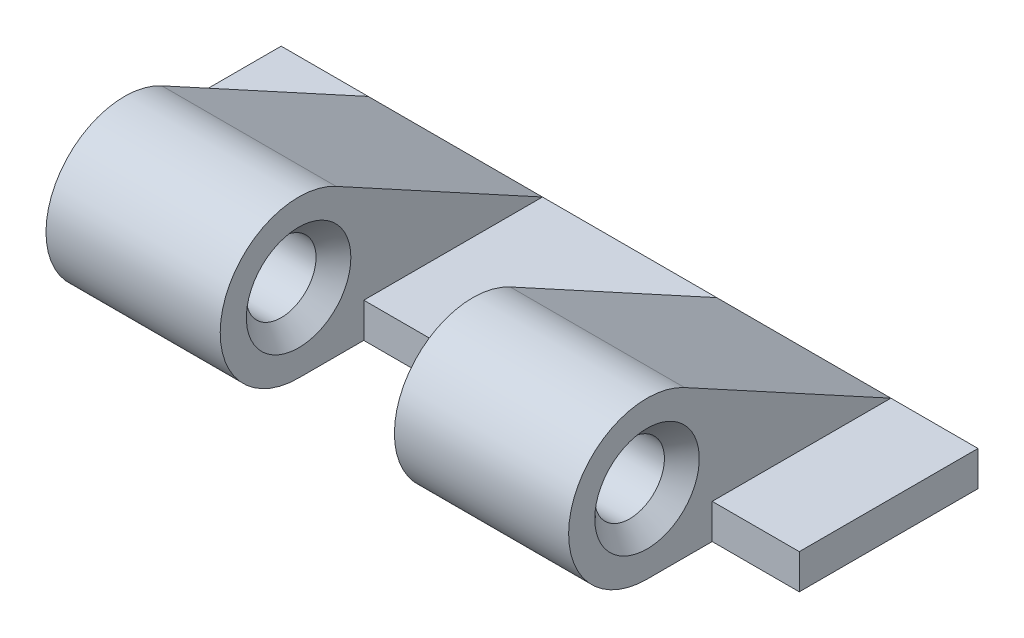
ISO-10303-21;
HEADER;
FILE_DESCRIPTION(('STEP AP214'),'2;1');
FILE_NAME('part.step','',(''),(''),'','','');
FILE_SCHEMA(('AUTOMOTIVE_DESIGN { 1 0 10303 214 1 1 1 1 }'));
ENDSEC;
DATA;
#1=APPLICATION_CONTEXT('core data for automotive mechanical design processes');
#2=APPLICATION_PROTOCOL_DEFINITION('international standard','automotive_design',2000,#1);
#3=PRODUCT_CONTEXT('',#1,'mechanical');
#4=PRODUCT('Part','Part','',(#3));
#5=PRODUCT_RELATED_PRODUCT_CATEGORY('part','',(#4));
#6=PRODUCT_DEFINITION_FORMATION('','',#4);
#7=PRODUCT_DEFINITION_CONTEXT('part definition',#1,'design');
#8=PRODUCT_DEFINITION('design','',#6,#7);
#9=PRODUCT_DEFINITION_SHAPE('','',#8);
#10=(LENGTH_UNIT() NAMED_UNIT(*) SI_UNIT(.MILLI.,.METRE.));
#11=(NAMED_UNIT(*) PLANE_ANGLE_UNIT() SI_UNIT($,.RADIAN.));
#12=(NAMED_UNIT(*) SI_UNIT($,.STERADIAN.) SOLID_ANGLE_UNIT());
#13=UNCERTAINTY_MEASURE_WITH_UNIT(LENGTH_MEASURE(1.E-05),#10,'distance_accuracy_value','');
#14=(GEOMETRIC_REPRESENTATION_CONTEXT(3) GLOBAL_UNCERTAINTY_ASSIGNED_CONTEXT((#13)) GLOBAL_UNIT_ASSIGNED_CONTEXT((#10,
#11,#12)) REPRESENTATION_CONTEXT('',''));
#15=CARTESIAN_POINT('',(0.,0.,0.));
#16=DIRECTION('',(0.,0.,1.));
#17=DIRECTION('',(1.,0.,0.));
#18=AXIS2_PLACEMENT_3D('',#15,#16,#17);
#19=CARTESIAN_POINT('',(0.,1.,0.));
#20=DIRECTION('',(0.,1.,0.));
#21=DIRECTION('',(0.,0.,1.));
#22=AXIS2_PLACEMENT_3D('',#19,#20,#21);
#23=PLANE('',#22);
#24=DIRECTION('',(1.,0.,0.));
#25=VECTOR('',#24,1.);
#26=CARTESIAN_POINT('',(-10.,1.,1.62917130661302));
#27=LINE('',#26,#25);
#28=CARTESIAN_POINT('',(-10.,1.,1.62917130661302));
#29=VERTEX_POINT('',#28);
#30=CARTESIAN_POINT('',(-7.5,1.,1.62917130661302));
#31=VERTEX_POINT('',#30);
#32=EDGE_CURVE('E151',#29,#31,#27,.T.);
#33=ORIENTED_EDGE('',*,*,#32,.T.);
#34=DIRECTION('',(0.,0.,1.));
#35=VECTOR('',#34,1.);
#36=CARTESIAN_POINT('',(-7.5,1.,-3.5));
#37=LINE('',#36,#35);
#38=CARTESIAN_POINT('',(-7.5,1.,-3.5));
#39=VERTEX_POINT('',#38);
#40=EDGE_CURVE('E150',#39,#31,#37,.T.);
#41=ORIENTED_EDGE('',*,*,#40,.F.);
#42=DIRECTION('',(-1.,0.,0.));
#43=VECTOR('',#42,1.);
#44=CARTESIAN_POINT('',(-7.5,1.,-3.5));
#45=LINE('',#44,#43);
#46=CARTESIAN_POINT('',(-10.,1.,-3.5));
#47=VERTEX_POINT('',#46);
#48=EDGE_CURVE('E137',#39,#47,#45,.T.);
#49=ORIENTED_EDGE('',*,*,#48,.T.);
#50=DIRECTION('',(0.,0.,1.));
#51=VECTOR('',#50,1.);
#52=CARTESIAN_POINT('',(-10.,1.,1.62917130661302));
#53=LINE('',#52,#51);
#54=EDGE_CURVE('E194',#47,#29,#53,.T.);
#55=ORIENTED_EDGE('',*,*,#54,.T.);
#56=EDGE_LOOP('',(#33,#41,#49,#55));
#57=FACE_BOUND('',#56,.T.);
#58=ADVANCED_FACE('F36',(#57),#23,.T.);
#59=CARTESIAN_POINT('',(-13.8639610306789,2.25,3.5));
#60=DIRECTION('',(1.,0.,0.));
#61=DIRECTION('',(0.,0.,-1.));
#62=AXIS2_PLACEMENT_3D('',#59,#60,#61);
#63=CYLINDRICAL_SURFACE('',#62,2.25);
#64=CARTESIAN_POINT('',(-2.5,2.25,3.5));
#65=DIRECTION('',(1.,0.,0.));
#66=DIRECTION('',(0.,0.,-1.));
#67=AXIS2_PLACEMENT_3D('',#64,#65,#66);
#68=CIRCLE('',#67,2.25);
#69=CARTESIAN_POINT('',(-2.5,4.22599868104726,2.42392880695584));
#70=VERTEX_POINT('',#69);
#71=CARTESIAN_POINT('',(-2.5,0.,3.5));
#72=VERTEX_POINT('',#71);
#73=EDGE_CURVE('E225',#70,#72,#68,.T.);
#74=ORIENTED_EDGE('',*,*,#73,.F.);
#75=DIRECTION('',(-1.,0.,0.));
#76=VECTOR('',#75,1.);
#77=CARTESIAN_POINT('',(4.24536878161602,4.22599868104727,2.42392880695584));
#78=LINE('',#77,#76);
#79=CARTESIAN_POINT('',(-7.5,4.22599868104727,2.42392880695584));
#80=VERTEX_POINT('',#79);
#81=EDGE_CURVE('E59',#70,#80,#78,.T.);
#82=ORIENTED_EDGE('',*,*,#81,.T.);
#83=CARTESIAN_POINT('',(-7.5,2.25,3.5));
#84=DIRECTION('',(1.,0.,0.));
#85=DIRECTION('',(0.,0.,-1.));
#86=AXIS2_PLACEMENT_3D('',#83,#84,#85);
#87=CIRCLE('',#86,2.25);
#88=CARTESIAN_POINT('',(-7.5,0.,3.5));
#89=VERTEX_POINT('',#88);
#90=EDGE_CURVE('E168',#89,#80,#87,.F.);
#91=ORIENTED_EDGE('',*,*,#90,.F.);
#92=DIRECTION('',(1.,0.,0.));
#93=VECTOR('',#92,1.);
#94=CARTESIAN_POINT('',(-7.5,0.,3.5));
#95=LINE('',#94,#93);
#96=EDGE_CURVE('E146',#89,#72,#95,.T.);
#97=ORIENTED_EDGE('',*,*,#96,.T.);
#98=EDGE_LOOP('',(#74,#82,#91,#97));
#99=FACE_BOUND('',#98,.T.);
#100=ADVANCED_FACE('F303',(#99),#63,.T.);
#101=CARTESIAN_POINT('',(10.,1.,-3.5));
#102=VERTEX_POINT('',#101);
#103=CARTESIAN_POINT('',(7.5,1.,-3.5));
#104=VERTEX_POINT('',#103);
#105=EDGE_CURVE('E148',#102,#104,#45,.T.);
#106=ORIENTED_EDGE('',*,*,#105,.T.);
#107=DIRECTION('',(0.,0.,-1.));
#108=VECTOR('',#107,1.);
#109=CARTESIAN_POINT('',(7.5,1.,-3.5));
#110=LINE('',#109,#108);
#111=CARTESIAN_POINT('',(7.5,1.,1.62917130661303));
#112=VERTEX_POINT('',#111);
#113=EDGE_CURVE('E165',#112,#104,#110,.T.);
#114=ORIENTED_EDGE('',*,*,#113,.F.);
#115=DIRECTION('',(-1.,0.,0.));
#116=VECTOR('',#115,1.);
#117=CARTESIAN_POINT('',(10.,1.,1.62917130661303));
#118=LINE('',#117,#116);
#119=CARTESIAN_POINT('',(10.,1.,1.62917130661303));
#120=VERTEX_POINT('',#119);
#121=EDGE_CURVE('E216',#120,#112,#118,.T.);
#122=ORIENTED_EDGE('',*,*,#121,.F.);
#123=DIRECTION('',(0.,0.,1.));
#124=VECTOR('',#123,1.);
#125=CARTESIAN_POINT('',(10.,1.,1.62917130661303));
#126=LINE('',#125,#124);
#127=EDGE_CURVE('E214',#102,#120,#126,.T.);
#128=ORIENTED_EDGE('',*,*,#127,.F.);
#129=EDGE_LOOP('',(#106,#114,#122,#128));
#130=FACE_BOUND('',#129,.T.);
#131=ADVANCED_FACE('F306',(#130),#23,.T.);
#132=DIRECTION('',(0.,0.,1.));
#133=VECTOR('',#132,1.);
#134=CARTESIAN_POINT('',(-2.5,1.,-3.5));
#135=LINE('',#134,#133);
#136=CARTESIAN_POINT('',(-2.49999999999999,1.,-3.5));
#137=VERTEX_POINT('',#136);
#138=CARTESIAN_POINT('',(-2.5,1.,1.62917130661302));
#139=VERTEX_POINT('',#138);
#140=EDGE_CURVE('E156',#137,#139,#135,.T.);
#141=ORIENTED_EDGE('',*,*,#140,.T.);
#142=DIRECTION('',(1.,0.,0.));
#143=VECTOR('',#142,1.);
#144=CARTESIAN_POINT('',(-2.5,1.,1.62917130661302));
#145=LINE('',#144,#143);
#146=CARTESIAN_POINT('',(2.5,1.,1.62917130661303));
#147=VERTEX_POINT('',#146);
#148=EDGE_CURVE('E239',#139,#147,#145,.T.);
#149=ORIENTED_EDGE('',*,*,#148,.T.);
#150=DIRECTION('',(0.,0.,1.));
#151=VECTOR('',#150,1.);
#152=CARTESIAN_POINT('',(2.5,1.,-3.5));
#153=LINE('',#152,#151);
#154=CARTESIAN_POINT('',(2.5,1.,-3.5));
#155=VERTEX_POINT('',#154);
#156=EDGE_CURVE('E174',#155,#147,#153,.T.);
#157=ORIENTED_EDGE('',*,*,#156,.F.);
#158=EDGE_CURVE('E145',#155,#137,#45,.T.);
#159=ORIENTED_EDGE('',*,*,#158,.T.);
#160=EDGE_LOOP('',(#141,#149,#157,#159));
#161=FACE_BOUND('',#160,.T.);
#162=ADVANCED_FACE('F305',(#161),#23,.T.);
#163=CARTESIAN_POINT('',(7.5,2.25,3.5));
#164=DIRECTION('',(1.,0.,0.));
#165=DIRECTION('',(0.,0.,-1.));
#166=AXIS2_PLACEMENT_3D('',#163,#164,#165);
#167=CIRCLE('',#166,2.25);
#168=CARTESIAN_POINT('',(7.5,4.22599868104726,2.42392880695584));
#169=VERTEX_POINT('',#168);
#170=CARTESIAN_POINT('',(7.5,0.,3.5));
#171=VERTEX_POINT('',#170);
#172=EDGE_CURVE('E242',#169,#171,#167,.T.);
#173=ORIENTED_EDGE('',*,*,#172,.F.);
#174=DIRECTION('',(1.,0.,0.));
#175=VECTOR('',#174,1.);
#176=CARTESIAN_POINT('',(-4.24536878161602,4.22599868104727,2.42392880695584));
#177=LINE('',#176,#175);
#178=CARTESIAN_POINT('',(2.5,4.22599868104727,2.42392880695584));
#179=VERTEX_POINT('',#178);
#180=EDGE_CURVE('E178',#179,#169,#177,.T.);
#181=ORIENTED_EDGE('',*,*,#180,.F.);
#182=CARTESIAN_POINT('',(2.5,2.25,3.5));
#183=DIRECTION('',(1.,0.,0.));
#184=DIRECTION('',(0.,0.,-1.));
#185=AXIS2_PLACEMENT_3D('',#182,#183,#184);
#186=CIRCLE('',#185,2.25);
#187=CARTESIAN_POINT('',(2.5,0.,3.5));
#188=VERTEX_POINT('',#187);
#189=EDGE_CURVE('E224',#179,#188,#186,.T.);
#190=ORIENTED_EDGE('',*,*,#189,.T.);
#191=EDGE_CURVE('E254',#188,#171,#95,.T.);
#192=ORIENTED_EDGE('',*,*,#191,.T.);
#193=EDGE_LOOP('',(#173,#181,#190,#192));
#194=FACE_BOUND('',#193,.T.);
#195=ADVANCED_FACE('F311',(#194),#63,.T.);
#196=CARTESIAN_POINT('',(7.5,1.,-3.5));
#197=DIRECTION('',(-1.,0.,0.));
#198=DIRECTION('',(0.,0.,1.));
#199=AXIS2_PLACEMENT_3D('',#196,#197,#198);
#200=PLANE('',#199);
#201=CARTESIAN_POINT('',(7.5,2.25,3.5));
#202=DIRECTION('',(-1.,0.,0.));
#203=DIRECTION('',(0.,0.,1.));
#204=AXIS2_PLACEMENT_3D('',#201,#202,#203);
#205=CIRCLE('',#204,1.50000000000002);
#206=CARTESIAN_POINT('',(7.5,2.25,5.00000000000002));
#207=VERTEX_POINT('',#206);
#208=EDGE_CURVE('E11',#207,#207,#205,.T.);
#209=ORIENTED_EDGE('',*,*,#208,.T.);
#210=EDGE_LOOP('',(#209));
#211=FACE_BOUND('',#210,.T.);
#212=DIRECTION('',(0.,-1.,0.));
#213=VECTOR('',#212,1.);
#214=CARTESIAN_POINT('',(7.5,1.,1.62917130661303));
#215=LINE('',#214,#213);
#216=CARTESIAN_POINT('',(7.5,0.,1.62917130661303));
#217=VERTEX_POINT('',#216);
#218=EDGE_CURVE('E204',#112,#217,#215,.T.);
#219=ORIENTED_EDGE('',*,*,#218,.F.);
#220=ORIENTED_EDGE('',*,*,#113,.T.);
#221=DIRECTION('',(0.,0.47825386357518,0.878221636021007));
#222=VECTOR('',#221,1.);
#223=CARTESIAN_POINT('',(7.5,1.,-3.5));
#224=LINE('',#223,#222);
#225=EDGE_CURVE('E181',#104,#169,#224,.T.);
#226=ORIENTED_EDGE('',*,*,#225,.T.);
#227=ORIENTED_EDGE('',*,*,#172,.T.);
#228=DIRECTION('',(0.,0.,-1.));
#229=VECTOR('',#228,1.);
#230=CARTESIAN_POINT('',(7.5,0.,-3.5));
#231=LINE('',#230,#229);
#232=EDGE_CURVE('E245',#171,#217,#231,.T.);
#233=ORIENTED_EDGE('',*,*,#232,.T.);
#234=EDGE_LOOP('',(#219,#220,#226,#227,#233));
#235=FACE_BOUND('',#234,.T.);
#236=ADVANCED_FACE('F328',(#211,#235),#200,.F.);
#237=CARTESIAN_POINT('',(0.,0.,0.));
#238=DIRECTION('',(0.,1.,0.));
#239=DIRECTION('',(0.,0.,1.));
#240=AXIS2_PLACEMENT_3D('',#237,#238,#239);
#241=PLANE('',#240);
#242=DIRECTION('',(0.,0.,-1.));
#243=VECTOR('',#242,1.);
#244=CARTESIAN_POINT('',(-2.5,0.,1.62917130661302));
#245=LINE('',#244,#243);
#246=CARTESIAN_POINT('',(-2.5,0.,1.62917130661302));
#247=VERTEX_POINT('',#246);
#248=EDGE_CURVE('E227',#72,#247,#245,.T.);
#249=ORIENTED_EDGE('',*,*,#248,.F.);
#250=ORIENTED_EDGE('',*,*,#96,.F.);
#251=DIRECTION('',(0.,0.,1.));
#252=VECTOR('',#251,1.);
#253=CARTESIAN_POINT('',(-7.5,0.,-3.5));
#254=LINE('',#253,#252);
#255=CARTESIAN_POINT('',(-7.5,0.,1.62917130661302));
#256=VERTEX_POINT('',#255);
#257=EDGE_CURVE('E252',#256,#89,#254,.T.);
#258=ORIENTED_EDGE('',*,*,#257,.F.);
#259=DIRECTION('',(1.,0.,0.));
#260=VECTOR('',#259,1.);
#261=CARTESIAN_POINT('',(-10.,0.,1.62917130661302));
#262=LINE('',#261,#260);
#263=CARTESIAN_POINT('',(-10.,0.,1.62917130661302));
#264=VERTEX_POINT('',#263);
#265=EDGE_CURVE('E200',#264,#256,#262,.T.);
#266=ORIENTED_EDGE('',*,*,#265,.F.);
#267=DIRECTION('',(0.,0.,-1.));
#268=VECTOR('',#267,1.);
#269=CARTESIAN_POINT('',(-10.,0.,1.62917130661302));
#270=LINE('',#269,#268);
#271=CARTESIAN_POINT('',(-10.,0.,-3.5));
#272=VERTEX_POINT('',#271);
#273=EDGE_CURVE('E197',#264,#272,#270,.T.);
#274=ORIENTED_EDGE('',*,*,#273,.T.);
#275=DIRECTION('',(-1.,0.,0.));
#276=VECTOR('',#275,1.);
#277=CARTESIAN_POINT('',(-7.5,0.,-3.5));
#278=LINE('',#277,#276);
#279=CARTESIAN_POINT('',(10.,0.,-3.5));
#280=VERTEX_POINT('',#279);
#281=EDGE_CURVE('E250',#280,#272,#278,.T.);
#282=ORIENTED_EDGE('',*,*,#281,.F.);
#283=DIRECTION('',(0.,0.,-1.));
#284=VECTOR('',#283,1.);
#285=CARTESIAN_POINT('',(10.,0.,1.62917130661303));
#286=LINE('',#285,#284);
#287=CARTESIAN_POINT('',(10.,0.,1.62917130661303));
#288=VERTEX_POINT('',#287);
#289=EDGE_CURVE('E208',#288,#280,#286,.T.);
#290=ORIENTED_EDGE('',*,*,#289,.F.);
#291=DIRECTION('',(-1.,0.,0.));
#292=VECTOR('',#291,1.);
#293=CARTESIAN_POINT('',(10.,0.,1.62917130661303));
#294=LINE('',#293,#292);
#295=EDGE_CURVE('E221',#288,#217,#294,.T.);
#296=ORIENTED_EDGE('',*,*,#295,.T.);
#297=ORIENTED_EDGE('',*,*,#232,.F.);
#298=ORIENTED_EDGE('',*,*,#191,.F.);
#299=DIRECTION('',(0.,0.,-1.));
#300=VECTOR('',#299,1.);
#301=CARTESIAN_POINT('',(2.5,0.,1.62917130661303));
#302=LINE('',#301,#300);
#303=CARTESIAN_POINT('',(2.5,0.,1.62917130661303));
#304=VERTEX_POINT('',#303);
#305=EDGE_CURVE('E235',#188,#304,#302,.T.);
#306=ORIENTED_EDGE('',*,*,#305,.T.);
#307=DIRECTION('',(1.,0.,0.));
#308=VECTOR('',#307,1.);
#309=CARTESIAN_POINT('',(-2.5,0.,1.62917130661302));
#310=LINE('',#309,#308);
#311=EDGE_CURVE('E233',#247,#304,#310,.T.);
#312=ORIENTED_EDGE('',*,*,#311,.F.);
#313=EDGE_LOOP('',(#249,#250,#258,#266,#274,#282,#290,#296,#297,#298,#306,#312));
#314=FACE_BOUND('',#313,.T.);
#315=ADVANCED_FACE('F342',(#314),#241,.F.);
#316=CARTESIAN_POINT('',(-13.8639610306789,2.25,3.5));
#317=DIRECTION('',(1.,0.,0.));
#318=DIRECTION('',(0.,0.,-1.));
#319=AXIS2_PLACEMENT_3D('',#316,#317,#318);
#320=CYLINDRICAL_SURFACE('',#319,1.);
#321=CARTESIAN_POINT('',(-6.99999999999999,2.25,3.5));
#322=DIRECTION('',(1.,0.,0.));
#323=DIRECTION('',(0.,0.,-1.));
#324=AXIS2_PLACEMENT_3D('',#321,#322,#323);
#325=CIRCLE('',#324,1.);
#326=CARTESIAN_POINT('',(-6.99999999999999,2.25,2.5));
#327=VERTEX_POINT('',#326);
#328=EDGE_CURVE('E259',#327,#327,#325,.F.);
#329=ORIENTED_EDGE('',*,*,#328,.T.);
#330=EDGE_LOOP('',(#329));
#331=FACE_BOUND('',#330,.T.);
#332=CARTESIAN_POINT('',(-3.,2.25,3.5));
#333=DIRECTION('',(1.,0.,0.));
#334=DIRECTION('',(0.,0.,-1.));
#335=AXIS2_PLACEMENT_3D('',#332,#333,#334);
#336=CIRCLE('',#335,1.);
#337=CARTESIAN_POINT('',(-3.,2.25,2.5));
#338=VERTEX_POINT('',#337);
#339=EDGE_CURVE('E248',#338,#338,#336,.T.);
#340=ORIENTED_EDGE('',*,*,#339,.T.);
#341=EDGE_LOOP('',(#340));
#342=FACE_BOUND('',#341,.T.);
#343=ADVANCED_FACE('F290',(#331,#342),#320,.F.);
#344=CARTESIAN_POINT('',(-7.5,1.,-3.5));
#345=DIRECTION('',(0.,0.,1.));
#346=DIRECTION('',(1.,0.,0.));
#347=AXIS2_PLACEMENT_3D('',#344,#345,#346);
#348=PLANE('',#347);
#349=ORIENTED_EDGE('',*,*,#281,.T.);
#350=DIRECTION('',(0.,1.,0.));
#351=VECTOR('',#350,1.);
#352=CARTESIAN_POINT('',(-10.,1.,-3.5));
#353=LINE('',#352,#351);
#354=EDGE_CURVE('E141',#272,#47,#353,.T.);
#355=ORIENTED_EDGE('',*,*,#354,.T.);
#356=ORIENTED_EDGE('',*,*,#48,.F.);
#357=DIRECTION('',(-1.,0.,0.));
#358=VECTOR('',#357,1.);
#359=CARTESIAN_POINT('',(4.24536878161602,1.,-3.5));
#360=LINE('',#359,#358);
#361=EDGE_CURVE('E51',#137,#39,#360,.T.);
#362=ORIENTED_EDGE('',*,*,#361,.F.);
#363=ORIENTED_EDGE('',*,*,#158,.F.);
#364=DIRECTION('',(1.,0.,0.));
#365=VECTOR('',#364,1.);
#366=CARTESIAN_POINT('',(-4.24536878161602,1.,-3.5));
#367=LINE('',#366,#365);
#368=EDGE_CURVE('E184',#155,#104,#367,.T.);
#369=ORIENTED_EDGE('',*,*,#368,.T.);
#370=ORIENTED_EDGE('',*,*,#105,.F.);
#371=DIRECTION('',(0.,1.,0.));
#372=VECTOR('',#371,1.);
#373=CARTESIAN_POINT('',(10.,1.,-3.5));
#374=LINE('',#373,#372);
#375=EDGE_CURVE('E211',#280,#102,#374,.T.);
#376=ORIENTED_EDGE('',*,*,#375,.F.);
#377=EDGE_LOOP('',(#349,#355,#356,#362,#363,#369,#370,#376));
#378=FACE_BOUND('',#377,.T.);
#379=ADVANCED_FACE('F139',(#378),#348,.F.);
#380=CARTESIAN_POINT('',(-7.5,1.,-3.5));
#381=DIRECTION('',(1.,0.,0.));
#382=DIRECTION('',(0.,0.,-1.));
#383=AXIS2_PLACEMENT_3D('',#380,#381,#382);
#384=PLANE('',#383);
#385=CARTESIAN_POINT('',(-7.5,2.25,3.5));
#386=DIRECTION('',(1.,0.,0.));
#387=DIRECTION('',(0.,0.,-1.));
#388=AXIS2_PLACEMENT_3D('',#385,#386,#387);
#389=CIRCLE('',#388,1.50000000000001);
#390=CARTESIAN_POINT('',(-7.5,2.25,1.99999999999999));
#391=VERTEX_POINT('',#390);
#392=EDGE_CURVE('E262',#391,#391,#389,.T.);
#393=ORIENTED_EDGE('',*,*,#392,.T.);
#394=EDGE_LOOP('',(#393));
#395=FACE_BOUND('',#394,.T.);
#396=ORIENTED_EDGE('',*,*,#90,.T.);
#397=DIRECTION('',(0.,-0.47825386357518,-0.878221636021006));
#398=VECTOR('',#397,1.);
#399=CARTESIAN_POINT('',(-7.5,1.,-3.5));
#400=LINE('',#399,#398);
#401=EDGE_CURVE('E157',#80,#39,#400,.T.);
#402=ORIENTED_EDGE('',*,*,#401,.T.);
#403=ORIENTED_EDGE('',*,*,#40,.T.);
#404=DIRECTION('',(0.,-1.,0.));
#405=VECTOR('',#404,1.);
#406=CARTESIAN_POINT('',(-7.5,1.,1.62917130661302));
#407=LINE('',#406,#405);
#408=EDGE_CURVE('E190',#31,#256,#407,.T.);
#409=ORIENTED_EDGE('',*,*,#408,.T.);
#410=ORIENTED_EDGE('',*,*,#257,.T.);
#411=EDGE_LOOP('',(#396,#402,#403,#409,#410));
#412=FACE_BOUND('',#411,.T.);
#413=ADVANCED_FACE('F167',(#395,#412),#384,.F.);
#414=CARTESIAN_POINT('',(3.00000000000001,2.25,3.5));
#415=DIRECTION('',(1.,0.,0.));
#416=DIRECTION('',(0.,0.,-1.));
#417=AXIS2_PLACEMENT_3D('',#414,#415,#416);
#418=CIRCLE('',#417,1.);
#419=CARTESIAN_POINT('',(3.00000000000001,2.25,2.5));
#420=VERTEX_POINT('',#419);
#421=EDGE_CURVE('E271',#420,#420,#418,.F.);
#422=ORIENTED_EDGE('',*,*,#421,.T.);
#423=EDGE_LOOP('',(#422));
#424=FACE_BOUND('',#423,.T.);
#425=CARTESIAN_POINT('',(6.99999999999999,2.25,3.5));
#426=DIRECTION('',(-1.,0.,0.));
#427=DIRECTION('',(0.,0.,1.));
#428=AXIS2_PLACEMENT_3D('',#425,#426,#427);
#429=CIRCLE('',#428,1.);
#430=CARTESIAN_POINT('',(6.99999999999999,2.25,4.5));
#431=VERTEX_POINT('',#430);
#432=EDGE_CURVE('E268',#431,#431,#429,.F.);
#433=ORIENTED_EDGE('',*,*,#432,.T.);
#434=EDGE_LOOP('',(#433));
#435=FACE_BOUND('',#434,.T.);
#436=ADVANCED_FACE('F285',(#424,#435),#320,.F.);
#437=CARTESIAN_POINT('',(-2.5,2.25,3.5));
#438=DIRECTION('',(1.,0.,0.));
#439=DIRECTION('',(0.,0.,-1.));
#440=AXIS2_PLACEMENT_3D('',#437,#438,#439);
#441=PLANE('',#440);
#442=DIRECTION('',(0.,1.,0.));
#443=VECTOR('',#442,1.);
#444=CARTESIAN_POINT('',(-2.5,1.,1.62917130661302));
#445=LINE('',#444,#443);
#446=EDGE_CURVE('E230',#247,#139,#445,.T.);
#447=ORIENTED_EDGE('',*,*,#446,.T.);
#448=ORIENTED_EDGE('',*,*,#140,.F.);
#449=DIRECTION('',(0.,-0.47825386357518,-0.878221636021006));
#450=VECTOR('',#449,1.);
#451=CARTESIAN_POINT('',(-2.5,0.999999999999999,-3.5));
#452=LINE('',#451,#450);
#453=EDGE_CURVE('E164',#70,#137,#452,.T.);
#454=ORIENTED_EDGE('',*,*,#453,.F.);
#455=ORIENTED_EDGE('',*,*,#73,.T.);
#456=ORIENTED_EDGE('',*,*,#248,.T.);
#457=EDGE_LOOP('',(#447,#448,#454,#455,#456));
#458=FACE_BOUND('',#457,.T.);
#459=CARTESIAN_POINT('',(-2.5,2.25,3.5));
#460=DIRECTION('',(1.,0.,0.));
#461=DIRECTION('',(0.,0.,-1.));
#462=AXIS2_PLACEMENT_3D('',#459,#460,#461);
#463=CIRCLE('',#462,1.49999999999999);
#464=CARTESIAN_POINT('',(-2.5,2.25,2.00000000000001));
#465=VERTEX_POINT('',#464);
#466=EDGE_CURVE('E265',#465,#465,#463,.F.);
#467=ORIENTED_EDGE('',*,*,#466,.T.);
#468=EDGE_LOOP('',(#467));
#469=FACE_BOUND('',#468,.T.);
#470=ADVANCED_FACE('F288',(#458,#469),#441,.T.);
#471=CARTESIAN_POINT('',(2.5,2.25,3.5));
#472=DIRECTION('',(1.,0.,0.));
#473=DIRECTION('',(0.,0.,-1.));
#474=AXIS2_PLACEMENT_3D('',#471,#472,#473);
#475=PLANE('',#474);
#476=CARTESIAN_POINT('',(2.5,2.25,3.5));
#477=DIRECTION('',(1.,0.,0.));
#478=DIRECTION('',(0.,0.,-1.));
#479=AXIS2_PLACEMENT_3D('',#476,#477,#478);
#480=CIRCLE('',#479,1.5);
#481=CARTESIAN_POINT('',(2.5,2.25,2.));
#482=VERTEX_POINT('',#481);
#483=EDGE_CURVE('E44',#482,#482,#480,.T.);
#484=ORIENTED_EDGE('',*,*,#483,.T.);
#485=EDGE_LOOP('',(#484));
#486=FACE_BOUND('',#485,.T.);
#487=ORIENTED_EDGE('',*,*,#189,.F.);
#488=DIRECTION('',(0.,-0.47825386357518,-0.878221636021007));
#489=VECTOR('',#488,1.);
#490=CARTESIAN_POINT('',(2.5,1.,-3.5));
#491=LINE('',#490,#489);
#492=EDGE_CURVE('E177',#179,#155,#491,.T.);
#493=ORIENTED_EDGE('',*,*,#492,.T.);
#494=ORIENTED_EDGE('',*,*,#156,.T.);
#495=DIRECTION('',(0.,1.,0.));
#496=VECTOR('',#495,1.);
#497=CARTESIAN_POINT('',(2.5,1.,1.62917130661303));
#498=LINE('',#497,#496);
#499=EDGE_CURVE('E228',#304,#147,#498,.T.);
#500=ORIENTED_EDGE('',*,*,#499,.F.);
#501=ORIENTED_EDGE('',*,*,#305,.F.);
#502=EDGE_LOOP('',(#487,#493,#494,#500,#501));
#503=FACE_BOUND('',#502,.T.);
#504=ADVANCED_FACE('F276',(#486,#503),#475,.F.);
#505=CARTESIAN_POINT('',(-2.5,1.,1.62917130661302));
#506=DIRECTION('',(0.,0.,-1.));
#507=DIRECTION('',(-1.,0.,0.));
#508=AXIS2_PLACEMENT_3D('',#505,#506,#507);
#509=PLANE('',#508);
#510=ORIENTED_EDGE('',*,*,#499,.T.);
#511=ORIENTED_EDGE('',*,*,#148,.F.);
#512=ORIENTED_EDGE('',*,*,#446,.F.);
#513=ORIENTED_EDGE('',*,*,#311,.T.);
#514=EDGE_LOOP('',(#510,#511,#512,#513));
#515=FACE_BOUND('',#514,.T.);
#516=ADVANCED_FACE('F354',(#515),#509,.F.);
#517=CARTESIAN_POINT('',(10.,1.,1.62917130661303));
#518=DIRECTION('',(0.,0.,-1.));
#519=DIRECTION('',(-1.,0.,0.));
#520=AXIS2_PLACEMENT_3D('',#517,#518,#519);
#521=PLANE('',#520);
#522=ORIENTED_EDGE('',*,*,#218,.T.);
#523=ORIENTED_EDGE('',*,*,#295,.F.);
#524=DIRECTION('',(0.,-1.,0.));
#525=VECTOR('',#524,1.);
#526=CARTESIAN_POINT('',(10.,1.,1.62917130661303));
#527=LINE('',#526,#525);
#528=EDGE_CURVE('E205',#120,#288,#527,.T.);
#529=ORIENTED_EDGE('',*,*,#528,.F.);
#530=ORIENTED_EDGE('',*,*,#121,.T.);
#531=EDGE_LOOP('',(#522,#523,#529,#530));
#532=FACE_BOUND('',#531,.T.);
#533=ADVANCED_FACE('F333',(#532),#521,.F.);
#534=CARTESIAN_POINT('',(10.,0.,0.));
#535=DIRECTION('',(1.,0.,0.));
#536=DIRECTION('',(0.,0.,-1.));
#537=AXIS2_PLACEMENT_3D('',#534,#535,#536);
#538=PLANE('',#537);
#539=ORIENTED_EDGE('',*,*,#528,.T.);
#540=ORIENTED_EDGE('',*,*,#289,.T.);
#541=ORIENTED_EDGE('',*,*,#375,.T.);
#542=ORIENTED_EDGE('',*,*,#127,.T.);
#543=EDGE_LOOP('',(#539,#540,#541,#542));
#544=FACE_BOUND('',#543,.T.);
#545=ADVANCED_FACE('F335',(#544),#538,.T.);
#546=CARTESIAN_POINT('',(-10.,1.,1.62917130661302));
#547=DIRECTION('',(0.,0.,1.));
#548=DIRECTION('',(1.,0.,0.));
#549=AXIS2_PLACEMENT_3D('',#546,#547,#548);
#550=PLANE('',#549);
#551=ORIENTED_EDGE('',*,*,#408,.F.);
#552=ORIENTED_EDGE('',*,*,#32,.F.);
#553=DIRECTION('',(0.,-1.,0.));
#554=VECTOR('',#553,1.);
#555=CARTESIAN_POINT('',(-10.,1.,1.62917130661302));
#556=LINE('',#555,#554);
#557=EDGE_CURVE('E191',#29,#264,#556,.T.);
#558=ORIENTED_EDGE('',*,*,#557,.T.);
#559=ORIENTED_EDGE('',*,*,#265,.T.);
#560=EDGE_LOOP('',(#551,#552,#558,#559));
#561=FACE_BOUND('',#560,.T.);
#562=ADVANCED_FACE('F346',(#561),#550,.T.);
#563=CARTESIAN_POINT('',(-10.,0.,0.));
#564=DIRECTION('',(-1.,0.,0.));
#565=DIRECTION('',(0.,0.,-1.));
#566=AXIS2_PLACEMENT_3D('',#563,#564,#565);
#567=PLANE('',#566);
#568=ORIENTED_EDGE('',*,*,#557,.F.);
#569=ORIENTED_EDGE('',*,*,#54,.F.);
#570=ORIENTED_EDGE('',*,*,#354,.F.);
#571=ORIENTED_EDGE('',*,*,#273,.F.);
#572=EDGE_LOOP('',(#568,#569,#570,#571));
#573=FACE_BOUND('',#572,.T.);
#574=ADVANCED_FACE('F340',(#573),#567,.T.);
#575=CARTESIAN_POINT('',(-6.99999999999999,2.25,3.5));
#576=DIRECTION('',(-1.,0.,0.));
#577=DIRECTION('',(0.,0.,1.));
#578=AXIS2_PLACEMENT_3D('',#575,#576,#577);
#579=CONICAL_SURFACE('',#578,1.,0.785398163397452);
#580=ORIENTED_EDGE('',*,*,#392,.F.);
#581=EDGE_LOOP('',(#580));
#582=FACE_BOUND('',#581,.T.);
#583=ORIENTED_EDGE('',*,*,#328,.F.);
#584=EDGE_LOOP('',(#583));
#585=FACE_BOUND('',#584,.T.);
#586=ADVANCED_FACE('F380',(#582,#585),#579,.F.);
#587=CARTESIAN_POINT('',(-2.5,2.25,3.5));
#588=DIRECTION('',(1.,0.,0.));
#589=DIRECTION('',(0.,0.,-1.));
#590=AXIS2_PLACEMENT_3D('',#587,#588,#589);
#591=CONICAL_SURFACE('',#590,1.49999999999999,0.785398163397443);
#592=ORIENTED_EDGE('',*,*,#339,.F.);
#593=EDGE_LOOP('',(#592));
#594=FACE_BOUND('',#593,.T.);
#595=ORIENTED_EDGE('',*,*,#466,.F.);
#596=EDGE_LOOP('',(#595));
#597=FACE_BOUND('',#596,.T.);
#598=ADVANCED_FACE('F282',(#594,#597),#591,.F.);
#599=CARTESIAN_POINT('',(3.00000000000001,2.25,3.5));
#600=DIRECTION('',(-1.,0.,0.));
#601=DIRECTION('',(0.,0.,1.));
#602=AXIS2_PLACEMENT_3D('',#599,#600,#601);
#603=CONICAL_SURFACE('',#602,1.,0.785398163397449);
#604=ORIENTED_EDGE('',*,*,#483,.F.);
#605=EDGE_LOOP('',(#604));
#606=FACE_BOUND('',#605,.T.);
#607=ORIENTED_EDGE('',*,*,#421,.F.);
#608=EDGE_LOOP('',(#607));
#609=FACE_BOUND('',#608,.T.);
#610=ADVANCED_FACE('F279',(#606,#609),#603,.F.);
#611=CARTESIAN_POINT('',(6.99999999999999,2.25,3.5));
#612=DIRECTION('',(1.,0.,0.));
#613=DIRECTION('',(0.,0.,-1.));
#614=AXIS2_PLACEMENT_3D('',#611,#612,#613);
#615=CONICAL_SURFACE('',#614,1.,0.785398163397452);
#616=ORIENTED_EDGE('',*,*,#208,.F.);
#617=EDGE_LOOP('',(#616));
#618=FACE_BOUND('',#617,.T.);
#619=ORIENTED_EDGE('',*,*,#432,.F.);
#620=EDGE_LOOP('',(#619));
#621=FACE_BOUND('',#620,.T.);
#622=ADVANCED_FACE('F38',(#618,#621),#615,.F.);
#623=CARTESIAN_POINT('',(-4.24536878161602,1.,-3.5));
#624=DIRECTION('',(0.,0.878221636021007,-0.47825386357518));
#625=DIRECTION('',(0.,0.47825386357518,0.878221636021007));
#626=AXIS2_PLACEMENT_3D('',#623,#624,#625);
#627=PLANE('',#626);
#628=ORIENTED_EDGE('',*,*,#492,.F.);
#629=ORIENTED_EDGE('',*,*,#180,.T.);
#630=ORIENTED_EDGE('',*,*,#225,.F.);
#631=ORIENTED_EDGE('',*,*,#368,.F.);
#632=EDGE_LOOP('',(#628,#629,#630,#631));
#633=FACE_BOUND('',#632,.T.);
#634=ADVANCED_FACE('F294',(#633),#627,.T.);
#635=CARTESIAN_POINT('',(4.24536878161602,1.,-3.5));
#636=DIRECTION('',(0.,0.878221636021006,-0.47825386357518));
#637=DIRECTION('',(0.,0.47825386357518,0.878221636021006));
#638=AXIS2_PLACEMENT_3D('',#635,#636,#637);
#639=PLANE('',#638);
#640=ORIENTED_EDGE('',*,*,#81,.F.);
#641=ORIENTED_EDGE('',*,*,#453,.T.);
#642=ORIENTED_EDGE('',*,*,#361,.T.);
#643=ORIENTED_EDGE('',*,*,#401,.F.);
#644=EDGE_LOOP('',(#640,#641,#642,#643));
#645=FACE_BOUND('',#644,.T.);
#646=ADVANCED_FACE('F162',(#645),#639,.T.);
#647=CLOSED_SHELL('',(#58,#100,#131,#162,#195,#236,#315,#343,#379,#413,#436,#470,#504,#516,#533,
#545,#562,#574,#586,#598,#610,#622,#634,#646));
#648=MANIFOLD_SOLID_BREP('B2',#647);
#649=ADVANCED_BREP_SHAPE_REPRESENTATION('',(#18,#648),#14);
#650=SHAPE_DEFINITION_REPRESENTATION(#9,#649);
ENDSEC;
END-ISO-10303-21;
